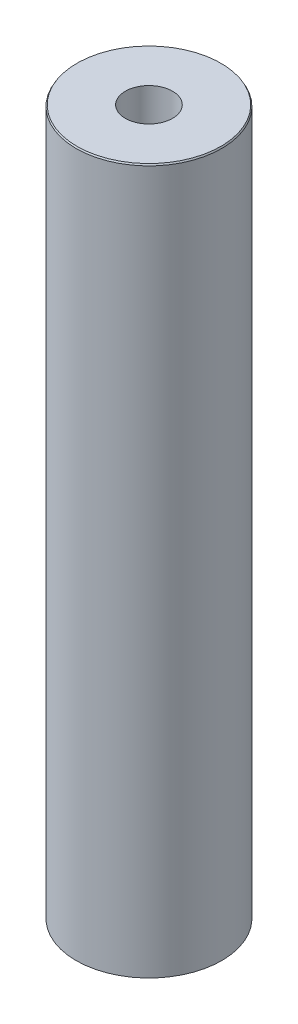
ISO-10303-21;
HEADER;
FILE_DESCRIPTION(('STEP AP214'),'2;1');
FILE_NAME('part.step','',(''),(''),'','','');
FILE_SCHEMA(('AUTOMOTIVE_DESIGN { 1 0 10303 214 1 1 1 1 }'));
ENDSEC;
DATA;
#1=APPLICATION_CONTEXT('core data for automotive mechanical design processes');
#2=APPLICATION_PROTOCOL_DEFINITION('international standard','automotive_design',2000,#1);
#3=PRODUCT_CONTEXT('',#1,'mechanical');
#4=PRODUCT('Part','Part','',(#3));
#5=PRODUCT_RELATED_PRODUCT_CATEGORY('part','',(#4));
#6=PRODUCT_DEFINITION_FORMATION('','',#4);
#7=PRODUCT_DEFINITION_CONTEXT('part definition',#1,'design');
#8=PRODUCT_DEFINITION('design','',#6,#7);
#9=PRODUCT_DEFINITION_SHAPE('','',#8);
#10=(LENGTH_UNIT() NAMED_UNIT(*) SI_UNIT(.MILLI.,.METRE.));
#11=(NAMED_UNIT(*) PLANE_ANGLE_UNIT() SI_UNIT($,.RADIAN.));
#12=(NAMED_UNIT(*) SI_UNIT($,.STERADIAN.) SOLID_ANGLE_UNIT());
#13=UNCERTAINTY_MEASURE_WITH_UNIT(LENGTH_MEASURE(1.E-05),#10,'distance_accuracy_value','');
#14=(GEOMETRIC_REPRESENTATION_CONTEXT(3) GLOBAL_UNCERTAINTY_ASSIGNED_CONTEXT((#13)) GLOBAL_UNIT_ASSIGNED_CONTEXT((#10,
#11,#12)) REPRESENTATION_CONTEXT('',''));
#15=CARTESIAN_POINT('',(0.,0.,0.));
#16=DIRECTION('',(0.,0.,1.));
#17=DIRECTION('',(1.,0.,0.));
#18=AXIS2_PLACEMENT_3D('',#15,#16,#17);
#19=CARTESIAN_POINT('',(0.,532.855554276898,0.));
#20=DIRECTION('',(0.,-1.,0.));
#21=DIRECTION('',(0.,0.,-1.));
#22=AXIS2_PLACEMENT_3D('',#19,#20,#21);
#23=CYLINDRICAL_SURFACE('',#22,55.);
#24=CARTESIAN_POINT('',(0.,531.762827351378,0.));
#25=DIRECTION('',(0.,1.,0.));
#26=DIRECTION('',(0.,0.,1.));
#27=AXIS2_PLACEMENT_3D('',#24,#25,#26);
#28=CIRCLE('',#27,55.);
#29=CARTESIAN_POINT('',(0.,531.762827351378,55.));
#30=VERTEX_POINT('',#29);
#31=EDGE_CURVE('E50',#30,#30,#28,.F.);
#32=ORIENTED_EDGE('',*,*,#31,.T.);
#33=EDGE_LOOP('',(#32));
#34=FACE_BOUND('',#33,.T.);
#35=CARTESIAN_POINT('',(0.,0.630886184599611,0.));
#36=DIRECTION('',(0.,1.,0.));
#37=DIRECTION('',(0.,0.,1.));
#38=AXIS2_PLACEMENT_3D('',#35,#36,#37);
#39=CIRCLE('',#38,55.);
#40=CARTESIAN_POINT('',(0.,0.630886184599611,55.));
#41=VERTEX_POINT('',#40);
#42=EDGE_CURVE('E51',#41,#41,#39,.T.);
#43=ORIENTED_EDGE('',*,*,#42,.T.);
#44=EDGE_LOOP('',(#43));
#45=FACE_BOUND('',#44,.T.);
#46=ADVANCED_FACE('F39',(#34,#45),#23,.T.);
#47=CARTESIAN_POINT('',(0.,532.855554276898,0.));
#48=DIRECTION('',(0.,1.,0.));
#49=DIRECTION('',(0.,0.,1.));
#50=AXIS2_PLACEMENT_3D('',#47,#48,#49);
#51=PLANE('',#50);
#52=CARTESIAN_POINT('',(0.,532.855554276898,0.));
#53=DIRECTION('',(0.,1.,0.));
#54=DIRECTION('',(0.,0.,1.));
#55=AXIS2_PLACEMENT_3D('',#52,#53,#54);
#56=CIRCLE('',#55,54.3691138154002);
#57=CARTESIAN_POINT('',(0.,532.855554276898,54.3691138154002));
#58=VERTEX_POINT('',#57);
#59=EDGE_CURVE('E54',#58,#58,#56,.T.);
#60=ORIENTED_EDGE('',*,*,#59,.T.);
#61=EDGE_LOOP('',(#60));
#62=FACE_BOUND('',#61,.T.);
#63=CARTESIAN_POINT('',(0.,532.855554276898,0.));
#64=DIRECTION('',(0.,1.,0.));
#65=DIRECTION('',(0.,0.,1.));
#66=AXIS2_PLACEMENT_3D('',#63,#64,#65);
#67=CIRCLE('',#66,17.8096642755035);
#68=CARTESIAN_POINT('',(0.,532.855554276898,17.8096642755035));
#69=VERTEX_POINT('',#68);
#70=EDGE_CURVE('E58',#69,#69,#67,.T.);
#71=ORIENTED_EDGE('',*,*,#70,.F.);
#72=EDGE_LOOP('',(#71));
#73=FACE_BOUND('',#72,.T.);
#74=ADVANCED_FACE('F69',(#62,#73),#51,.T.);
#75=CARTESIAN_POINT('',(0.,0.,0.));
#76=DIRECTION('',(0.,1.,0.));
#77=DIRECTION('',(0.,0.,1.));
#78=AXIS2_PLACEMENT_3D('',#75,#76,#77);
#79=PLANE('',#78);
#80=CARTESIAN_POINT('',(0.,0.,0.));
#81=DIRECTION('',(0.,1.,0.));
#82=DIRECTION('',(0.,0.,1.));
#83=AXIS2_PLACEMENT_3D('',#80,#81,#82);
#84=CIRCLE('',#83,53.9072730744801);
#85=CARTESIAN_POINT('',(0.,0.,53.9072730744801));
#86=VERTEX_POINT('',#85);
#87=EDGE_CURVE('E10',#86,#86,#84,.F.);
#88=ORIENTED_EDGE('',*,*,#87,.T.);
#89=EDGE_LOOP('',(#88));
#90=FACE_BOUND('',#89,.T.);
#91=CARTESIAN_POINT('',(0.,0.,0.));
#92=DIRECTION('',(0.,1.,0.));
#93=DIRECTION('',(0.,0.,1.));
#94=AXIS2_PLACEMENT_3D('',#91,#92,#93);
#95=CIRCLE('',#94,17.8096642755035);
#96=CARTESIAN_POINT('',(0.,0.,17.8096642755035));
#97=VERTEX_POINT('',#96);
#98=EDGE_CURVE('E63',#97,#97,#95,.T.);
#99=ORIENTED_EDGE('',*,*,#98,.T.);
#100=EDGE_LOOP('',(#99));
#101=FACE_BOUND('',#100,.T.);
#102=ADVANCED_FACE('F75',(#90,#101),#79,.F.);
#103=CARTESIAN_POINT('',(0.,532.855554276898,0.));
#104=DIRECTION('',(0.,-1.,0.));
#105=DIRECTION('',(0.,0.,-1.));
#106=AXIS2_PLACEMENT_3D('',#103,#104,#105);
#107=CYLINDRICAL_SURFACE('',#106,17.8096642755035);
#108=ORIENTED_EDGE('',*,*,#70,.T.);
#109=EDGE_LOOP('',(#108));
#110=FACE_BOUND('',#109,.T.);
#111=ORIENTED_EDGE('',*,*,#98,.F.);
#112=EDGE_LOOP('',(#111));
#113=FACE_BOUND('',#112,.T.);
#114=ADVANCED_FACE('F70',(#110,#113),#107,.F.);
#115=CARTESIAN_POINT('',(0.,532.855554276898,0.));
#116=DIRECTION('',(0.,-1.,0.));
#117=DIRECTION('',(0.,0.,-1.));
#118=AXIS2_PLACEMENT_3D('',#115,#116,#117);
#119=CONICAL_SURFACE('',#118,54.3691138154002,0.523598775598259);
#120=ORIENTED_EDGE('',*,*,#31,.F.);
#121=EDGE_LOOP('',(#120));
#122=FACE_BOUND('',#121,.T.);
#123=ORIENTED_EDGE('',*,*,#59,.F.);
#124=EDGE_LOOP('',(#123));
#125=FACE_BOUND('',#124,.T.);
#126=ADVANCED_FACE('F81',(#122,#125),#119,.T.);
#127=CARTESIAN_POINT('',(0.,0.630886184599611,0.));
#128=DIRECTION('',(0.,1.,0.));
#129=DIRECTION('',(0.,0.,1.));
#130=AXIS2_PLACEMENT_3D('',#127,#128,#129);
#131=CONICAL_SURFACE('',#130,55.,1.04719755119663);
#132=ORIENTED_EDGE('',*,*,#87,.F.);
#133=EDGE_LOOP('',(#132));
#134=FACE_BOUND('',#133,.T.);
#135=ORIENTED_EDGE('',*,*,#42,.F.);
#136=EDGE_LOOP('',(#135));
#137=FACE_BOUND('',#136,.T.);
#138=ADVANCED_FACE('F45',(#134,#137),#131,.T.);
#139=CLOSED_SHELL('',(#46,#74,#102,#114,#126,#138));
#140=MANIFOLD_SOLID_BREP('B2',#139);
#141=ADVANCED_BREP_SHAPE_REPRESENTATION('',(#18,#140),#14);
#142=SHAPE_DEFINITION_REPRESENTATION(#9,#141);
ENDSEC;
END-ISO-10303-21;
